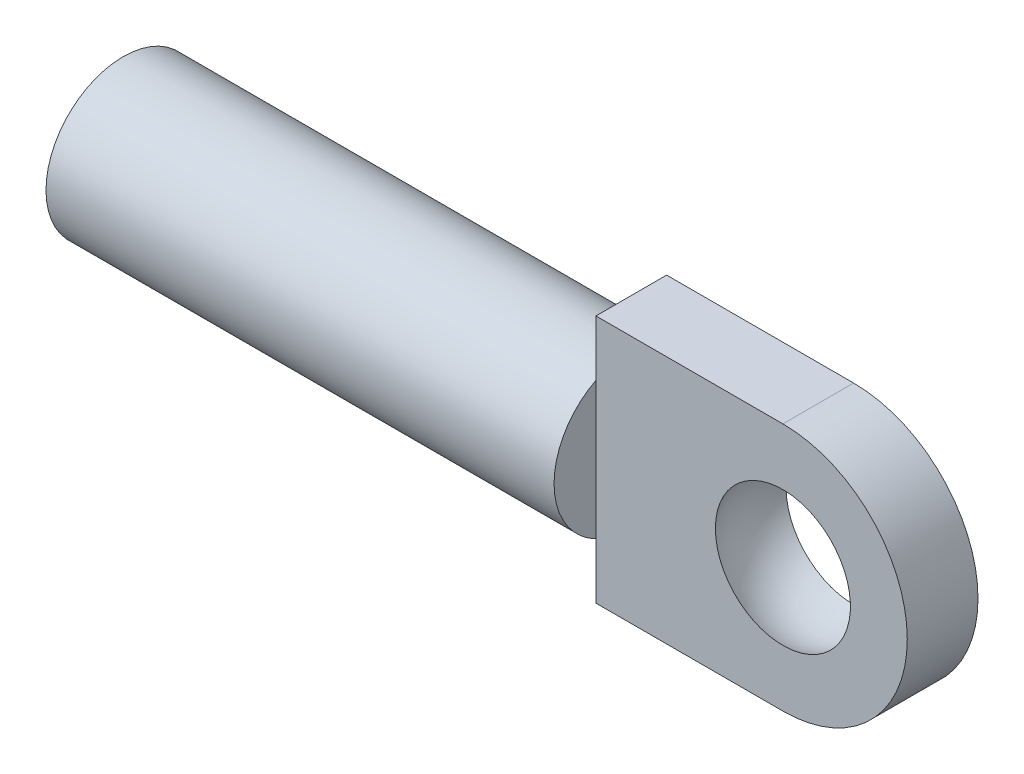
ISO-10303-21;
HEADER;
FILE_DESCRIPTION(('STEP AP214'),'2;1');
FILE_NAME('part.step','',(''),(''),'','','');
FILE_SCHEMA(('AUTOMOTIVE_DESIGN { 1 0 10303 214 1 1 1 1 }'));
ENDSEC;
DATA;
#1=APPLICATION_CONTEXT('core data for automotive mechanical design processes');
#2=APPLICATION_PROTOCOL_DEFINITION('international standard','automotive_design',2000,#1);
#3=PRODUCT_CONTEXT('',#1,'mechanical');
#4=PRODUCT('Part','Part','',(#3));
#5=PRODUCT_RELATED_PRODUCT_CATEGORY('part','',(#4));
#6=PRODUCT_DEFINITION_FORMATION('','',#4);
#7=PRODUCT_DEFINITION_CONTEXT('part definition',#1,'design');
#8=PRODUCT_DEFINITION('design','',#6,#7);
#9=PRODUCT_DEFINITION_SHAPE('','',#8);
#10=(LENGTH_UNIT() NAMED_UNIT(*) SI_UNIT(.MILLI.,.METRE.));
#11=(NAMED_UNIT(*) PLANE_ANGLE_UNIT() SI_UNIT($,.RADIAN.));
#12=(NAMED_UNIT(*) SI_UNIT($,.STERADIAN.) SOLID_ANGLE_UNIT());
#13=UNCERTAINTY_MEASURE_WITH_UNIT(LENGTH_MEASURE(1.E-05),#10,'distance_accuracy_value','');
#14=(GEOMETRIC_REPRESENTATION_CONTEXT(3) GLOBAL_UNCERTAINTY_ASSIGNED_CONTEXT((#13)) GLOBAL_UNIT_ASSIGNED_CONTEXT((#10,
#11,#12)) REPRESENTATION_CONTEXT('',''));
#15=CARTESIAN_POINT('',(0.,0.,0.));
#16=DIRECTION('',(0.,0.,1.));
#17=DIRECTION('',(1.,0.,0.));
#18=AXIS2_PLACEMENT_3D('',#15,#16,#17);
#19=CARTESIAN_POINT('',(0.,0.,-1.1049));
#20=DIRECTION('',(0.,0.,-1.));
#21=DIRECTION('',(-1.,0.,0.));
#22=AXIS2_PLACEMENT_3D('',#19,#20,#21);
#23=PLANE('',#22);
#24=CARTESIAN_POINT('',(0.,0.,-1.1049));
#25=DIRECTION('',(0.,0.,1.));
#26=DIRECTION('',(-1.,0.,0.));
#27=AXIS2_PLACEMENT_3D('',#24,#25,#26);
#28=CIRCLE('',#27,3.8862);
#29=CARTESIAN_POINT('',(0.,-3.8862,-1.1049));
#30=VERTEX_POINT('',#29);
#31=CARTESIAN_POINT('',(0.,3.8862,-1.1049));
#32=VERTEX_POINT('',#31);
#33=EDGE_CURVE('E126',#30,#32,#28,.T.);
#34=ORIENTED_EDGE('',*,*,#33,.F.);
#35=DIRECTION('',(1.,0.,0.));
#36=VECTOR('',#35,1.);
#37=CARTESIAN_POINT('',(0.,-3.8862,-1.1049));
#38=LINE('',#37,#36);
#39=CARTESIAN_POINT('',(-5.842,-3.8862,-1.1049));
#40=VERTEX_POINT('',#39);
#41=EDGE_CURVE('E135',#40,#30,#38,.T.);
#42=ORIENTED_EDGE('',*,*,#41,.F.);
#43=DIRECTION('',(0.,-1.,0.));
#44=VECTOR('',#43,1.);
#45=CARTESIAN_POINT('',(-5.842,3.8862,-1.1049));
#46=LINE('',#45,#44);
#47=CARTESIAN_POINT('',(-5.842,-2.14517248490652,-1.1049));
#48=VERTEX_POINT('',#47);
#49=EDGE_CURVE('E132',#48,#40,#46,.T.);
#50=ORIENTED_EDGE('',*,*,#49,.F.);
#51=CARTESIAN_POINT('',(-5.842,2.14517248490652,-1.1049));
#52=VERTEX_POINT('',#51);
#53=EDGE_CURVE('E56',#52,#48,#46,.T.);
#54=ORIENTED_EDGE('',*,*,#53,.F.);
#55=CARTESIAN_POINT('',(-5.842,3.8862,-1.1049));
#56=VERTEX_POINT('',#55);
#57=EDGE_CURVE('E133',#56,#52,#46,.T.);
#58=ORIENTED_EDGE('',*,*,#57,.F.);
#59=DIRECTION('',(-1.,0.,0.));
#60=VECTOR('',#59,1.);
#61=CARTESIAN_POINT('',(0.,3.8862,-1.1049));
#62=LINE('',#61,#60);
#63=EDGE_CURVE('E129',#32,#56,#62,.T.);
#64=ORIENTED_EDGE('',*,*,#63,.F.);
#65=EDGE_LOOP('',(#34,#42,#50,#54,#58,#64));
#66=FACE_BOUND('',#65,.T.);
#67=CARTESIAN_POINT('',(0.,0.,-1.1049));
#68=DIRECTION('',(0.,0.,-1.));
#69=DIRECTION('',(-1.,0.,0.));
#70=AXIS2_PLACEMENT_3D('',#67,#68,#69);
#71=CIRCLE('',#70,2.10939506790454);
#72=CARTESIAN_POINT('',(-2.10939506790454,0.,-1.1049));
#73=VERTEX_POINT('',#72);
#74=EDGE_CURVE('E276',#73,#73,#71,.F.);
#75=ORIENTED_EDGE('',*,*,#74,.T.);
#76=EDGE_LOOP('',(#75));
#77=FACE_BOUND('',#76,.T.);
#78=ADVANCED_FACE('F32',(#66,#77),#23,.T.);
#79=CARTESIAN_POINT('',(0.,0.,1.1049));
#80=DIRECTION('',(0.,0.,-1.));
#81=DIRECTION('',(-1.,0.,0.));
#82=AXIS2_PLACEMENT_3D('',#79,#80,#81);
#83=PLANE('',#82);
#84=CARTESIAN_POINT('',(0.,0.,1.1049));
#85=DIRECTION('',(0.,0.,1.));
#86=DIRECTION('',(-1.,0.,0.));
#87=AXIS2_PLACEMENT_3D('',#84,#85,#86);
#88=CIRCLE('',#87,3.8862);
#89=CARTESIAN_POINT('',(0.,-3.8862,1.1049));
#90=VERTEX_POINT('',#89);
#91=CARTESIAN_POINT('',(0.,3.8862,1.1049));
#92=VERTEX_POINT('',#91);
#93=EDGE_CURVE('E121',#90,#92,#88,.T.);
#94=ORIENTED_EDGE('',*,*,#93,.T.);
#95=DIRECTION('',(-1.,0.,0.));
#96=VECTOR('',#95,1.);
#97=CARTESIAN_POINT('',(0.,3.8862,1.1049));
#98=LINE('',#97,#96);
#99=CARTESIAN_POINT('',(-5.842,3.8862,1.1049));
#100=VERTEX_POINT('',#99);
#101=EDGE_CURVE('E107',#92,#100,#98,.T.);
#102=ORIENTED_EDGE('',*,*,#101,.T.);
#103=DIRECTION('',(0.,-1.,0.));
#104=VECTOR('',#103,1.);
#105=CARTESIAN_POINT('',(-5.842,3.8862,1.1049));
#106=LINE('',#105,#104);
#107=CARTESIAN_POINT('',(-5.842,2.14517248490652,1.1049));
#108=VERTEX_POINT('',#107);
#109=EDGE_CURVE('E98',#100,#108,#106,.T.);
#110=ORIENTED_EDGE('',*,*,#109,.T.);
#111=CARTESIAN_POINT('',(-5.842,-2.14517248490652,1.1049));
#112=VERTEX_POINT('',#111);
#113=EDGE_CURVE('E89',#108,#112,#106,.T.);
#114=ORIENTED_EDGE('',*,*,#113,.T.);
#115=CARTESIAN_POINT('',(-5.842,-3.8862,1.1049));
#116=VERTEX_POINT('',#115);
#117=EDGE_CURVE('E94',#112,#116,#106,.T.);
#118=ORIENTED_EDGE('',*,*,#117,.T.);
#119=DIRECTION('',(1.,0.,0.));
#120=VECTOR('',#119,1.);
#121=CARTESIAN_POINT('',(0.,-3.8862,1.1049));
#122=LINE('',#121,#120);
#123=EDGE_CURVE('E124',#116,#90,#122,.T.);
#124=ORIENTED_EDGE('',*,*,#123,.T.);
#125=EDGE_LOOP('',(#94,#102,#110,#114,#118,#124));
#126=FACE_BOUND('',#125,.T.);
#127=CARTESIAN_POINT('',(0.,0.,1.1049));
#128=DIRECTION('',(0.,0.,-1.));
#129=DIRECTION('',(-1.,0.,0.));
#130=AXIS2_PLACEMENT_3D('',#127,#128,#129);
#131=CIRCLE('',#130,2.10939506790454);
#132=CARTESIAN_POINT('',(-2.10939506790454,0.,1.1049));
#133=VERTEX_POINT('',#132);
#134=EDGE_CURVE('E36',#133,#133,#131,.F.);
#135=ORIENTED_EDGE('',*,*,#134,.F.);
#136=EDGE_LOOP('',(#135));
#137=FACE_BOUND('',#136,.T.);
#138=ADVANCED_FACE('F91',(#126,#137),#83,.F.);
#139=CARTESIAN_POINT('',(-5.842,3.8862,-1.1049));
#140=DIRECTION('',(-1.,0.,0.));
#141=DIRECTION('',(0.,-1.,0.));
#142=AXIS2_PLACEMENT_3D('',#139,#140,#141);
#143=PLANE('',#142);
#144=CARTESIAN_POINT('',(-5.842,0.,0.));
#145=DIRECTION('',(-1.,0.,0.));
#146=DIRECTION('',(0.,0.,1.));
#147=AXIS2_PLACEMENT_3D('',#144,#145,#146);
#148=CIRCLE('',#147,2.413);
#149=EDGE_CURVE('E43',#108,#52,#148,.T.);
#150=ORIENTED_EDGE('',*,*,#149,.F.);
#151=ORIENTED_EDGE('',*,*,#109,.F.);
#152=DIRECTION('',(0.,0.,1.));
#153=VECTOR('',#152,1.);
#154=CARTESIAN_POINT('',(-5.842,3.8862,-1.1049));
#155=LINE('',#154,#153);
#156=EDGE_CURVE('E141',#56,#100,#155,.T.);
#157=ORIENTED_EDGE('',*,*,#156,.F.);
#158=ORIENTED_EDGE('',*,*,#57,.T.);
#159=EDGE_LOOP('',(#150,#151,#157,#158));
#160=FACE_BOUND('',#159,.T.);
#161=ADVANCED_FACE('F154',(#160),#143,.T.);
#162=CARTESIAN_POINT('',(0.,0.,-1.1049));
#163=DIRECTION('',(0.,0.,1.));
#164=DIRECTION('',(1.,0.,0.));
#165=AXIS2_PLACEMENT_3D('',#162,#163,#164);
#166=CYLINDRICAL_SURFACE('',#165,3.8862);
#167=DIRECTION('',(0.,0.,1.));
#168=VECTOR('',#167,1.);
#169=CARTESIAN_POINT('',(0.,3.8862,-1.1049));
#170=LINE('',#169,#168);
#171=EDGE_CURVE('E138',#32,#92,#170,.T.);
#172=ORIENTED_EDGE('',*,*,#171,.T.);
#173=ORIENTED_EDGE('',*,*,#93,.F.);
#174=DIRECTION('',(0.,0.,1.));
#175=VECTOR('',#174,1.);
#176=CARTESIAN_POINT('',(0.,-3.8862,-1.1049));
#177=LINE('',#176,#175);
#178=EDGE_CURVE('E41',#30,#90,#177,.T.);
#179=ORIENTED_EDGE('',*,*,#178,.F.);
#180=ORIENTED_EDGE('',*,*,#33,.T.);
#181=EDGE_LOOP('',(#172,#173,#179,#180));
#182=FACE_BOUND('',#181,.T.);
#183=ADVANCED_FACE('F34',(#182),#166,.T.);
#184=CARTESIAN_POINT('',(0.,-3.8862,-1.1049));
#185=DIRECTION('',(0.,-1.,0.));
#186=DIRECTION('',(1.,0.,0.));
#187=AXIS2_PLACEMENT_3D('',#184,#185,#186);
#188=PLANE('',#187);
#189=ORIENTED_EDGE('',*,*,#178,.T.);
#190=ORIENTED_EDGE('',*,*,#123,.F.);
#191=DIRECTION('',(0.,0.,1.));
#192=VECTOR('',#191,1.);
#193=CARTESIAN_POINT('',(-5.842,-3.8862,-1.1049));
#194=LINE('',#193,#192);
#195=EDGE_CURVE('E105',#40,#116,#194,.T.);
#196=ORIENTED_EDGE('',*,*,#195,.F.);
#197=ORIENTED_EDGE('',*,*,#41,.T.);
#198=EDGE_LOOP('',(#189,#190,#196,#197));
#199=FACE_BOUND('',#198,.T.);
#200=ADVANCED_FACE('F150',(#199),#188,.T.);
#201=EDGE_CURVE('E11',#48,#112,#148,.T.);
#202=ORIENTED_EDGE('',*,*,#201,.F.);
#203=ORIENTED_EDGE('',*,*,#49,.T.);
#204=ORIENTED_EDGE('',*,*,#195,.T.);
#205=ORIENTED_EDGE('',*,*,#117,.F.);
#206=EDGE_LOOP('',(#202,#203,#204,#205));
#207=FACE_BOUND('',#206,.T.);
#208=ADVANCED_FACE('F103',(#207),#143,.T.);
#209=CARTESIAN_POINT('',(0.,3.8862,-1.1049));
#210=DIRECTION('',(0.,1.,0.));
#211=DIRECTION('',(-1.,0.,0.));
#212=AXIS2_PLACEMENT_3D('',#209,#210,#211);
#213=PLANE('',#212);
#214=ORIENTED_EDGE('',*,*,#156,.T.);
#215=ORIENTED_EDGE('',*,*,#101,.F.);
#216=ORIENTED_EDGE('',*,*,#171,.F.);
#217=ORIENTED_EDGE('',*,*,#63,.T.);
#218=EDGE_LOOP('',(#214,#215,#216,#217));
#219=FACE_BOUND('',#218,.T.);
#220=ADVANCED_FACE('F148',(#219),#213,.T.);
#221=CARTESIAN_POINT('',(-5.842,0.,0.));
#222=DIRECTION('',(-1.,0.,0.));
#223=DIRECTION('',(0.,0.,1.));
#224=AXIS2_PLACEMENT_3D('',#221,#222,#223);
#225=PLANE('',#224);
#226=EDGE_CURVE('E44',#52,#48,#148,.T.);
#227=ORIENTED_EDGE('',*,*,#226,.F.);
#228=ORIENTED_EDGE('',*,*,#53,.T.);
#229=EDGE_LOOP('',(#227,#228));
#230=FACE_BOUND('',#229,.T.);
#231=ADVANCED_FACE('F185',(#230),#225,.F.);
#232=CARTESIAN_POINT('',(-21.717,0.,0.));
#233=DIRECTION('',(1.,0.,0.));
#234=DIRECTION('',(0.,0.,-1.));
#235=AXIS2_PLACEMENT_3D('',#232,#233,#234);
#236=CYLINDRICAL_SURFACE('',#235,2.413);
#237=CARTESIAN_POINT('',(-21.717,0.,0.));
#238=DIRECTION('',(-1.,0.,0.));
#239=DIRECTION('',(0.,0.,1.));
#240=AXIS2_PLACEMENT_3D('',#237,#238,#239);
#241=CIRCLE('',#240,2.413);
#242=CARTESIAN_POINT('',(-21.717,0.,2.413));
#243=VERTEX_POINT('',#242);
#244=EDGE_CURVE('E117',#243,#243,#241,.T.);
#245=ORIENTED_EDGE('',*,*,#244,.F.);
#246=EDGE_LOOP('',(#245));
#247=FACE_BOUND('',#246,.T.);
#248=ORIENTED_EDGE('',*,*,#149,.T.);
#249=ORIENTED_EDGE('',*,*,#226,.T.);
#250=ORIENTED_EDGE('',*,*,#201,.T.);
#251=EDGE_CURVE('E108',#112,#108,#148,.T.);
#252=ORIENTED_EDGE('',*,*,#251,.T.);
#253=EDGE_LOOP('',(#248,#249,#250,#252));
#254=FACE_BOUND('',#253,.T.);
#255=ADVANCED_FACE('F114',(#247,#254),#236,.T.);
#256=CARTESIAN_POINT('',(-21.717,0.,0.));
#257=DIRECTION('',(-1.,0.,0.));
#258=DIRECTION('',(0.,0.,1.));
#259=AXIS2_PLACEMENT_3D('',#256,#257,#258);
#260=PLANE('',#259);
#261=CARTESIAN_POINT('',(-21.717,0.,0.));
#262=DIRECTION('',(-1.,0.,0.));
#263=DIRECTION('',(0.,0.,1.));
#264=AXIS2_PLACEMENT_3D('',#261,#262,#263);
#265=CIRCLE('',#264,1.2065);
#266=CARTESIAN_POINT('',(-21.717,0.,1.2065));
#267=VERTEX_POINT('',#266);
#268=EDGE_CURVE('E279',#267,#267,#265,.T.);
#269=ORIENTED_EDGE('',*,*,#268,.F.);
#270=EDGE_LOOP('',(#269));
#271=FACE_BOUND('',#270,.T.);
#272=ORIENTED_EDGE('',*,*,#244,.T.);
#273=EDGE_LOOP('',(#272));
#274=FACE_BOUND('',#273,.T.);
#275=ADVANCED_FACE('F196',(#271,#274),#260,.T.);
#276=ORIENTED_EDGE('',*,*,#113,.F.);
#277=ORIENTED_EDGE('',*,*,#251,.F.);
#278=EDGE_LOOP('',(#276,#277));
#279=FACE_BOUND('',#278,.T.);
#280=ADVANCED_FACE('F109',(#279),#225,.F.);
#281=CARTESIAN_POINT('',(-6.858,0.,0.));
#282=DIRECTION('',(-1.,0.,0.));
#283=DIRECTION('',(0.,0.,1.));
#284=AXIS2_PLACEMENT_3D('',#281,#282,#283);
#285=CYLINDRICAL_SURFACE('',#284,1.2065);
#286=CARTESIAN_POINT('',(-6.858,0.,0.));
#287=DIRECTION('',(-1.,0.,0.));
#288=DIRECTION('',(0.,0.,1.));
#289=AXIS2_PLACEMENT_3D('',#286,#287,#288);
#290=CIRCLE('',#289,1.2065);
#291=CARTESIAN_POINT('',(-6.858,0.,1.2065));
#292=VERTEX_POINT('',#291);
#293=EDGE_CURVE('E112',#292,#292,#290,.T.);
#294=ORIENTED_EDGE('',*,*,#293,.F.);
#295=EDGE_LOOP('',(#294));
#296=FACE_BOUND('',#295,.T.);
#297=ORIENTED_EDGE('',*,*,#268,.T.);
#298=EDGE_LOOP('',(#297));
#299=FACE_BOUND('',#298,.T.);
#300=ADVANCED_FACE('F211',(#296,#299),#285,.F.);
#301=CARTESIAN_POINT('',(-6.858,0.,0.));
#302=DIRECTION('',(-1.,0.,0.));
#303=DIRECTION('',(0.,0.,1.));
#304=AXIS2_PLACEMENT_3D('',#301,#302,#303);
#305=PLANE('',#304);
#306=ORIENTED_EDGE('',*,*,#293,.T.);
#307=EDGE_LOOP('',(#306));
#308=FACE_BOUND('',#307,.T.);
#309=ADVANCED_FACE('F216',(#308),#305,.T.);
#310=CARTESIAN_POINT('',(0.,0.,0.));
#311=DIRECTION('',(0.,-1.,0.));
#312=DIRECTION('',(-1.,0.,0.));
#313=AXIS2_PLACEMENT_3D('',#310,#311,#312);
#314=SPHERICAL_SURFACE('',#313,2.38125);
#315=CARTESIAN_POINT('',(0.,0.,0.));
#316=DIRECTION('',(0.,0.,-1.));
#317=DIRECTION('',(-1.,0.,0.));
#318=AXIS2_PLACEMENT_3D('',#315,#316,#317);
#319=SPHERICAL_SURFACE('',#318,2.38125);
#320=ORIENTED_EDGE('',*,*,#74,.F.);
#321=EDGE_LOOP('',(#320));
#322=FACE_BOUND('',#321,.T.);
#323=ORIENTED_EDGE('',*,*,#134,.T.);
#324=EDGE_LOOP('',(#323));
#325=FACE_BOUND('',#324,.T.);
#326=ADVANCED_FACE('F224',(#322,#325),#319,.F.);
#327=CLOSED_SHELL('',(#78,#138,#161,#183,#200,#208,#220,#231,#255,#275,#280,#300,#309,#326));
#328=MANIFOLD_SOLID_BREP('B2',#327);
#329=ADVANCED_BREP_SHAPE_REPRESENTATION('',(#18,#328),#14);
#330=SHAPE_DEFINITION_REPRESENTATION(#9,#329);
ENDSEC;
END-ISO-10303-21;
